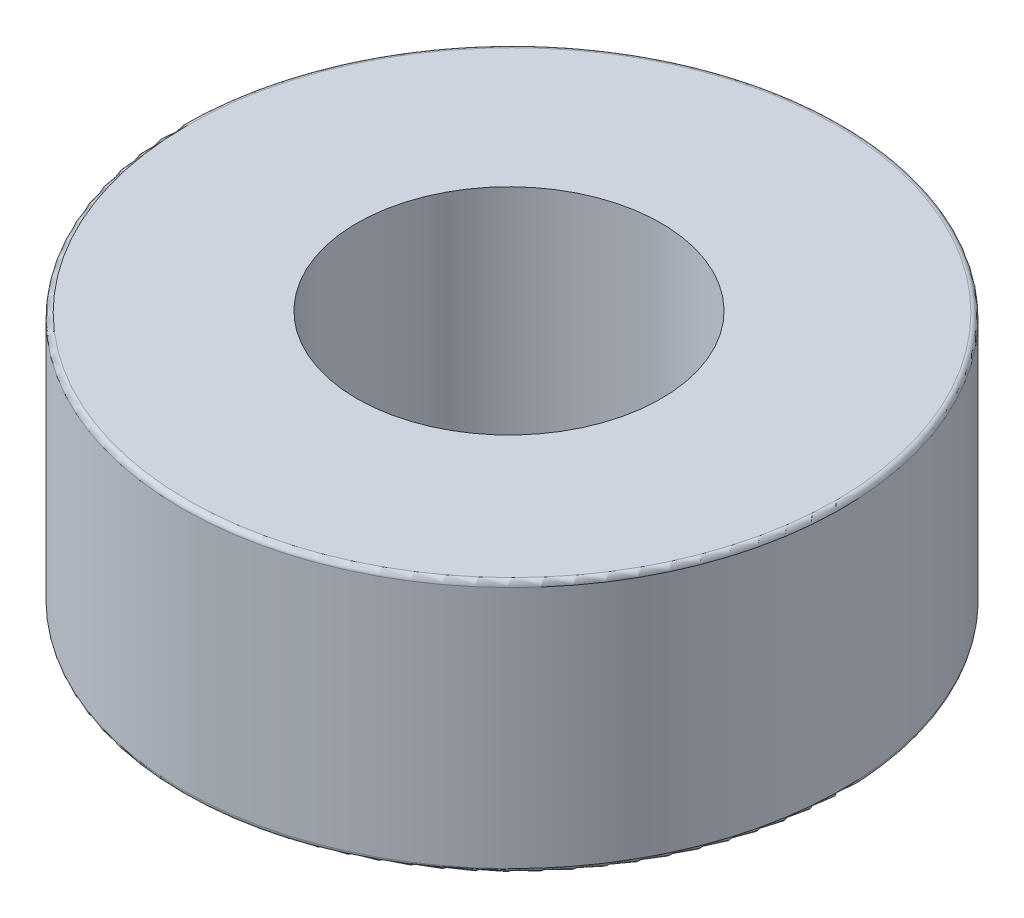
ISO-10303-21;
HEADER;
FILE_DESCRIPTION(('STEP AP214'),'2;1');
FILE_NAME('part.step','',(''),(''),'','','');
FILE_SCHEMA(('AUTOMOTIVE_DESIGN { 1 0 10303 214 1 1 1 1 }'));
ENDSEC;
DATA;
#1=APPLICATION_CONTEXT('core data for automotive mechanical design processes');
#2=APPLICATION_PROTOCOL_DEFINITION('international standard','automotive_design',2000,#1);
#3=PRODUCT_CONTEXT('',#1,'mechanical');
#4=PRODUCT('Part','Part','',(#3));
#5=PRODUCT_RELATED_PRODUCT_CATEGORY('part','',(#4));
#6=PRODUCT_DEFINITION_FORMATION('','',#4);
#7=PRODUCT_DEFINITION_CONTEXT('part definition',#1,'design');
#8=PRODUCT_DEFINITION('design','',#6,#7);
#9=PRODUCT_DEFINITION_SHAPE('','',#8);
#10=(LENGTH_UNIT() NAMED_UNIT(*) SI_UNIT(.MILLI.,.METRE.));
#11=(NAMED_UNIT(*) PLANE_ANGLE_UNIT() SI_UNIT($,.RADIAN.));
#12=(NAMED_UNIT(*) SI_UNIT($,.STERADIAN.) SOLID_ANGLE_UNIT());
#13=UNCERTAINTY_MEASURE_WITH_UNIT(LENGTH_MEASURE(1.E-05),#10,'distance_accuracy_value','');
#14=(GEOMETRIC_REPRESENTATION_CONTEXT(3) GLOBAL_UNCERTAINTY_ASSIGNED_CONTEXT((#13)) GLOBAL_UNIT_ASSIGNED_CONTEXT((#10,
#11,#12)) REPRESENTATION_CONTEXT('',''));
#15=CARTESIAN_POINT('',(0.,0.,0.));
#16=DIRECTION('',(0.,0.,1.));
#17=DIRECTION('',(1.,0.,0.));
#18=AXIS2_PLACEMENT_3D('',#15,#16,#17);
#19=CARTESIAN_POINT('',(0.0597931372441155,5.,0.));
#20=DIRECTION('',(0.,1.,0.));
#21=DIRECTION('',(0.,0.,1.));
#22=AXIS2_PLACEMENT_3D('',#19,#20,#21);
#23=PLANE('',#22);
#24=CARTESIAN_POINT('',(0.0597931372441155,5.,0.));
#25=DIRECTION('',(0.,1.,0.));
#26=DIRECTION('',(0.,0.,1.));
#27=AXIS2_PLACEMENT_3D('',#24,#25,#26);
#28=CIRCLE('',#27,6.4);
#29=CARTESIAN_POINT('',(0.0597931372441155,5.,6.4));
#30=VERTEX_POINT('',#29);
#31=EDGE_CURVE('E10',#30,#30,#28,.T.);
#32=ORIENTED_EDGE('',*,*,#31,.T.);
#33=EDGE_LOOP('',(#32));
#34=FACE_BOUND('',#33,.T.);
#35=CARTESIAN_POINT('',(0.,5.,0.));
#36=DIRECTION('',(0.,1.,0.));
#37=DIRECTION('',(0.,0.,1.));
#38=AXIS2_PLACEMENT_3D('',#35,#36,#37);
#39=CIRCLE('',#38,3.);
#40=CARTESIAN_POINT('',(0.,5.,3.));
#41=VERTEX_POINT('',#40);
#42=EDGE_CURVE('E56',#41,#41,#39,.T.);
#43=ORIENTED_EDGE('',*,*,#42,.F.);
#44=EDGE_LOOP('',(#43));
#45=FACE_BOUND('',#44,.T.);
#46=ADVANCED_FACE('F36',(#34,#45),#23,.T.);
#47=CARTESIAN_POINT('',(0.0597931372441155,0.,0.));
#48=DIRECTION('',(0.,1.,0.));
#49=DIRECTION('',(0.,0.,1.));
#50=AXIS2_PLACEMENT_3D('',#47,#48,#49);
#51=PLANE('',#50);
#52=CARTESIAN_POINT('',(0.0597931372441155,0.,0.));
#53=DIRECTION('',(0.,1.,0.));
#54=DIRECTION('',(0.,0.,1.));
#55=AXIS2_PLACEMENT_3D('',#52,#53,#54);
#56=CIRCLE('',#55,6.4);
#57=CARTESIAN_POINT('',(0.0597931372441155,0.,6.4));
#58=VERTEX_POINT('',#57);
#59=EDGE_CURVE('E43',#58,#58,#56,.F.);
#60=ORIENTED_EDGE('',*,*,#59,.T.);
#61=EDGE_LOOP('',(#60));
#62=FACE_BOUND('',#61,.T.);
#63=CARTESIAN_POINT('',(0.,0.,0.));
#64=DIRECTION('',(0.,1.,0.));
#65=DIRECTION('',(0.,0.,1.));
#66=AXIS2_PLACEMENT_3D('',#63,#64,#65);
#67=CIRCLE('',#66,3.);
#68=CARTESIAN_POINT('',(0.,0.,3.));
#69=VERTEX_POINT('',#68);
#70=EDGE_CURVE('E57',#69,#69,#67,.T.);
#71=ORIENTED_EDGE('',*,*,#70,.T.);
#72=EDGE_LOOP('',(#71));
#73=FACE_BOUND('',#72,.T.);
#74=ADVANCED_FACE('F67',(#62,#73),#51,.F.);
#75=CARTESIAN_POINT('',(0.0597931372441155,5.,0.));
#76=DIRECTION('',(0.,-1.,0.));
#77=DIRECTION('',(0.,0.,-1.));
#78=AXIS2_PLACEMENT_3D('',#75,#76,#77);
#79=CYLINDRICAL_SURFACE('',#78,6.5);
#80=CARTESIAN_POINT('',(0.0597931372441155,0.1,0.));
#81=DIRECTION('',(0.,1.,0.));
#82=DIRECTION('',(0.,0.,1.));
#83=AXIS2_PLACEMENT_3D('',#80,#81,#82);
#84=CIRCLE('',#83,6.5);
#85=CARTESIAN_POINT('',(0.0597931372441155,0.1,6.5));
#86=VERTEX_POINT('',#85);
#87=EDGE_CURVE('E47',#86,#86,#84,.T.);
#88=ORIENTED_EDGE('',*,*,#87,.T.);
#89=EDGE_LOOP('',(#88));
#90=FACE_BOUND('',#89,.T.);
#91=CARTESIAN_POINT('',(0.0597931372441155,4.9,0.));
#92=DIRECTION('',(0.,1.,0.));
#93=DIRECTION('',(0.,0.,1.));
#94=AXIS2_PLACEMENT_3D('',#91,#92,#93);
#95=CIRCLE('',#94,6.5);
#96=CARTESIAN_POINT('',(0.0597931372441155,4.9,6.5));
#97=VERTEX_POINT('',#96);
#98=EDGE_CURVE('E51',#97,#97,#95,.F.);
#99=ORIENTED_EDGE('',*,*,#98,.T.);
#100=EDGE_LOOP('',(#99));
#101=FACE_BOUND('',#100,.T.);
#102=ADVANCED_FACE('F72',(#90,#101),#79,.T.);
#103=CARTESIAN_POINT('',(0.,5.,0.));
#104=DIRECTION('',(0.,-1.,0.));
#105=DIRECTION('',(0.,0.,-1.));
#106=AXIS2_PLACEMENT_3D('',#103,#104,#105);
#107=CYLINDRICAL_SURFACE('',#106,3.);
#108=ORIENTED_EDGE('',*,*,#42,.T.);
#109=EDGE_LOOP('',(#108));
#110=FACE_BOUND('',#109,.T.);
#111=ORIENTED_EDGE('',*,*,#70,.F.);
#112=EDGE_LOOP('',(#111));
#113=FACE_BOUND('',#112,.T.);
#114=ADVANCED_FACE('F63',(#110,#113),#107,.F.);
#115=CARTESIAN_POINT('',(0.0597931372441155,0.1,0.));
#116=DIRECTION('',(0.,1.,0.));
#117=DIRECTION('',(0.,0.,1.));
#118=AXIS2_PLACEMENT_3D('',#115,#116,#117);
#119=TOROIDAL_SURFACE('',#118,6.4,0.1);
#120=ORIENTED_EDGE('',*,*,#59,.F.);
#121=EDGE_LOOP('',(#120));
#122=FACE_BOUND('',#121,.T.);
#123=ORIENTED_EDGE('',*,*,#87,.F.);
#124=EDGE_LOOP('',(#123));
#125=FACE_BOUND('',#124,.T.);
#126=ADVANCED_FACE('F78',(#122,#125),#119,.T.);
#127=CARTESIAN_POINT('',(0.0597931372441155,4.9,0.));
#128=DIRECTION('',(0.,1.,0.));
#129=DIRECTION('',(0.,0.,1.));
#130=AXIS2_PLACEMENT_3D('',#127,#128,#129);
#131=TOROIDAL_SURFACE('',#130,6.4,0.1);
#132=ORIENTED_EDGE('',*,*,#98,.F.);
#133=EDGE_LOOP('',(#132));
#134=FACE_BOUND('',#133,.T.);
#135=ORIENTED_EDGE('',*,*,#31,.F.);
#136=EDGE_LOOP('',(#135));
#137=FACE_BOUND('',#136,.T.);
#138=ADVANCED_FACE('F38',(#134,#137),#131,.T.);
#139=CLOSED_SHELL('',(#46,#74,#102,#114,#126,#138));
#140=MANIFOLD_SOLID_BREP('B2',#139);
#141=ADVANCED_BREP_SHAPE_REPRESENTATION('',(#18,#140),#14);
#142=SHAPE_DEFINITION_REPRESENTATION(#9,#141);
ENDSEC;
END-ISO-10303-21;
